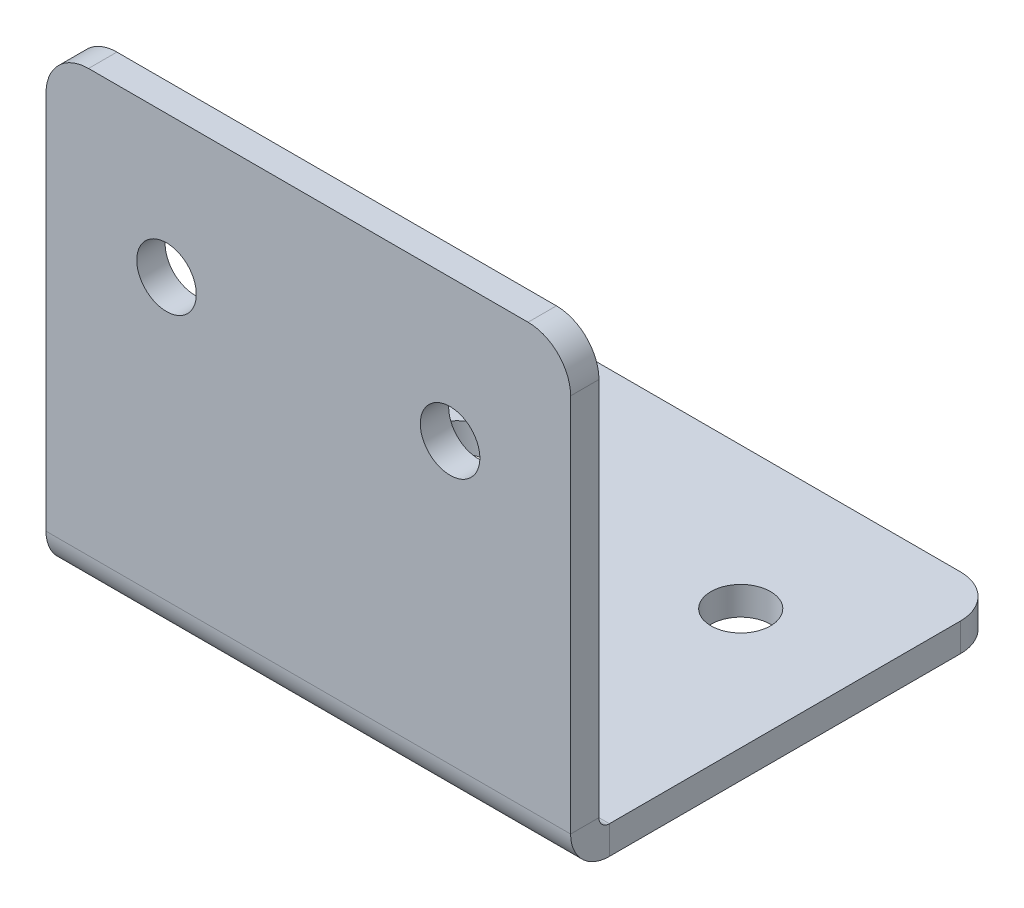
ISO-10303-21;
HEADER;
FILE_DESCRIPTION(('STEP AP214'),'2;1');
FILE_NAME('part.step','',(''),(''),'','','');
FILE_SCHEMA(('AUTOMOTIVE_DESIGN { 1 0 10303 214 1 1 1 1 }'));
ENDSEC;
DATA;
#1=APPLICATION_CONTEXT('core data for automotive mechanical design processes');
#2=APPLICATION_PROTOCOL_DEFINITION('international standard','automotive_design',2000,#1);
#3=PRODUCT_CONTEXT('',#1,'mechanical');
#4=PRODUCT('Part','Part','',(#3));
#5=PRODUCT_RELATED_PRODUCT_CATEGORY('part','',(#4));
#6=PRODUCT_DEFINITION_FORMATION('','',#4);
#7=PRODUCT_DEFINITION_CONTEXT('part definition',#1,'design');
#8=PRODUCT_DEFINITION('design','',#6,#7);
#9=PRODUCT_DEFINITION_SHAPE('','',#8);
#10=(LENGTH_UNIT() NAMED_UNIT(*) SI_UNIT(.MILLI.,.METRE.));
#11=(NAMED_UNIT(*) PLANE_ANGLE_UNIT() SI_UNIT($,.RADIAN.));
#12=(NAMED_UNIT(*) SI_UNIT($,.STERADIAN.) SOLID_ANGLE_UNIT());
#13=UNCERTAINTY_MEASURE_WITH_UNIT(LENGTH_MEASURE(1.E-05),#10,'distance_accuracy_value','');
#14=(GEOMETRIC_REPRESENTATION_CONTEXT(3) GLOBAL_UNCERTAINTY_ASSIGNED_CONTEXT((#13)) GLOBAL_UNIT_ASSIGNED_CONTEXT((#10,
#11,#12)) REPRESENTATION_CONTEXT('',''));
#15=CARTESIAN_POINT('',(0.,0.,0.));
#16=DIRECTION('',(0.,0.,1.));
#17=DIRECTION('',(1.,0.,0.));
#18=AXIS2_PLACEMENT_3D('',#15,#16,#17);
#19=CARTESIAN_POINT('',(18.5,-2.,-13.75));
#20=DIRECTION('',(1.,0.,0.));
#21=DIRECTION('',(0.,0.,-1.));
#22=AXIS2_PLACEMENT_3D('',#19,#20,#21);
#23=PLANE('',#22);
#24=DIRECTION('',(0.,0.,-1.));
#25=VECTOR('',#24,1.);
#26=CARTESIAN_POINT('',(18.5,0.,-13.75));
#27=LINE('',#26,#25);
#28=CARTESIAN_POINT('',(18.5,0.,11.0134));
#29=VERTEX_POINT('',#28);
#30=CARTESIAN_POINT('',(18.5,0.,-13.75));
#31=VERTEX_POINT('',#30);
#32=EDGE_CURVE('E260',#29,#31,#27,.T.);
#33=ORIENTED_EDGE('',*,*,#32,.F.);
#34=DIRECTION('',(0.,-1.,0.));
#35=VECTOR('',#34,1.);
#36=CARTESIAN_POINT('',(18.5,0.,11.0134));
#37=LINE('',#36,#35);
#38=CARTESIAN_POINT('',(18.5,-2.,11.0134));
#39=VERTEX_POINT('',#38);
#40=EDGE_CURVE('E235',#29,#39,#37,.T.);
#41=ORIENTED_EDGE('',*,*,#40,.T.);
#42=DIRECTION('',(0.,0.,-1.));
#43=VECTOR('',#42,1.);
#44=CARTESIAN_POINT('',(18.5,-2.,-13.75));
#45=LINE('',#44,#43);
#46=CARTESIAN_POINT('',(18.5,-2.,-13.75));
#47=VERTEX_POINT('',#46);
#48=EDGE_CURVE('E120',#39,#47,#45,.T.);
#49=ORIENTED_EDGE('',*,*,#48,.T.);
#50=DIRECTION('',(0.,1.,0.));
#51=VECTOR('',#50,1.);
#52=CARTESIAN_POINT('',(18.5,-2.,-13.75));
#53=LINE('',#52,#51);
#54=EDGE_CURVE('E74',#47,#31,#53,.T.);
#55=ORIENTED_EDGE('',*,*,#54,.T.);
#56=EDGE_LOOP('',(#33,#41,#49,#55));
#57=FACE_BOUND('',#56,.T.);
#58=ADVANCED_FACE('F71',(#57),#23,.T.);
#59=CARTESIAN_POINT('',(-15.5,-2.,-13.75));
#60=DIRECTION('',(0.,1.,0.));
#61=DIRECTION('',(0.,0.,1.));
#62=AXIS2_PLACEMENT_3D('',#59,#60,#61);
#63=PLANE('',#62);
#64=CARTESIAN_POINT('',(-10.,-2.,-6.75));
#65=DIRECTION('',(0.,1.,0.));
#66=DIRECTION('',(0.,0.,1.));
#67=AXIS2_PLACEMENT_3D('',#64,#65,#66);
#68=CIRCLE('',#67,2.1);
#69=CARTESIAN_POINT('',(-10.,-2.,-4.65));
#70=VERTEX_POINT('',#69);
#71=EDGE_CURVE('E257',#70,#70,#68,.T.);
#72=ORIENTED_EDGE('',*,*,#71,.T.);
#73=EDGE_LOOP('',(#72));
#74=FACE_BOUND('',#73,.T.);
#75=CARTESIAN_POINT('',(10.,-2.,-6.75));
#76=DIRECTION('',(0.,1.,0.));
#77=DIRECTION('',(0.,0.,-1.));
#78=AXIS2_PLACEMENT_3D('',#75,#76,#77);
#79=CIRCLE('',#78,2.1);
#80=CARTESIAN_POINT('',(10.,-2.,-8.85));
#81=VERTEX_POINT('',#80);
#82=EDGE_CURVE('E251',#81,#81,#79,.T.);
#83=ORIENTED_EDGE('',*,*,#82,.T.);
#84=EDGE_LOOP('',(#83));
#85=FACE_BOUND('',#84,.T.);
#86=DIRECTION('',(1.,0.,0.));
#87=VECTOR('',#86,1.);
#88=CARTESIAN_POINT('',(18.5,-2.,11.0134));
#89=LINE('',#88,#87);
#90=CARTESIAN_POINT('',(-18.5,-2.,11.0134));
#91=VERTEX_POINT('',#90);
#92=EDGE_CURVE('E229',#39,#91,#89,.F.);
#93=ORIENTED_EDGE('',*,*,#92,.T.);
#94=DIRECTION('',(0.,0.,1.));
#95=VECTOR('',#94,1.);
#96=CARTESIAN_POINT('',(-18.5,-2.,-13.75));
#97=LINE('',#96,#95);
#98=CARTESIAN_POINT('',(-18.5,-2.,-13.75));
#99=VERTEX_POINT('',#98);
#100=EDGE_CURVE('E273',#99,#91,#97,.T.);
#101=ORIENTED_EDGE('',*,*,#100,.F.);
#102=CARTESIAN_POINT('',(-15.5,-2.,-13.75));
#103=DIRECTION('',(0.,1.,0.));
#104=DIRECTION('',(0.,0.,1.));
#105=AXIS2_PLACEMENT_3D('',#102,#103,#104);
#106=CIRCLE('',#105,3.);
#107=CARTESIAN_POINT('',(-15.5,-2.,-16.75));
#108=VERTEX_POINT('',#107);
#109=EDGE_CURVE('E271',#108,#99,#106,.T.);
#110=ORIENTED_EDGE('',*,*,#109,.F.);
#111=DIRECTION('',(-1.,0.,0.));
#112=VECTOR('',#111,1.);
#113=CARTESIAN_POINT('',(-15.5,-2.,-16.75));
#114=LINE('',#113,#112);
#115=CARTESIAN_POINT('',(15.5,-2.,-16.75));
#116=VERTEX_POINT('',#115);
#117=EDGE_CURVE('E268',#116,#108,#114,.T.);
#118=ORIENTED_EDGE('',*,*,#117,.F.);
#119=CARTESIAN_POINT('',(15.5,-2.,-13.75));
#120=DIRECTION('',(0.,1.,0.));
#121=DIRECTION('',(0.,0.,-1.));
#122=AXIS2_PLACEMENT_3D('',#119,#120,#121);
#123=CIRCLE('',#122,3.);
#124=EDGE_CURVE('E264',#47,#116,#123,.T.);
#125=ORIENTED_EDGE('',*,*,#124,.F.);
#126=ORIENTED_EDGE('',*,*,#48,.F.);
#127=EDGE_LOOP('',(#93,#101,#110,#118,#125,#126));
#128=FACE_BOUND('',#127,.T.);
#129=ADVANCED_FACE('F309',(#74,#85,#128),#63,.F.);
#130=CARTESIAN_POINT('',(-15.5,0.,-13.75));
#131=DIRECTION('',(0.,1.,0.));
#132=DIRECTION('',(0.,0.,1.));
#133=AXIS2_PLACEMENT_3D('',#130,#131,#132);
#134=PLANE('',#133);
#135=CARTESIAN_POINT('',(10.,0.,-6.75));
#136=DIRECTION('',(0.,1.,0.));
#137=DIRECTION('',(0.,0.,-1.));
#138=AXIS2_PLACEMENT_3D('',#135,#136,#137);
#139=CIRCLE('',#138,2.1);
#140=CARTESIAN_POINT('',(10.,0.,-8.85));
#141=VERTEX_POINT('',#140);
#142=EDGE_CURVE('E249',#141,#141,#139,.T.);
#143=ORIENTED_EDGE('',*,*,#142,.F.);
#144=EDGE_LOOP('',(#143));
#145=FACE_BOUND('',#144,.T.);
#146=CARTESIAN_POINT('',(-10.,0.,-6.75));
#147=DIRECTION('',(0.,1.,0.));
#148=DIRECTION('',(0.,0.,1.));
#149=AXIS2_PLACEMENT_3D('',#146,#147,#148);
#150=CIRCLE('',#149,2.1);
#151=CARTESIAN_POINT('',(-10.,0.,-4.65));
#152=VERTEX_POINT('',#151);
#153=EDGE_CURVE('E254',#152,#152,#150,.T.);
#154=ORIENTED_EDGE('',*,*,#153,.F.);
#155=EDGE_LOOP('',(#154));
#156=FACE_BOUND('',#155,.T.);
#157=DIRECTION('',(0.,0.,1.));
#158=VECTOR('',#157,1.);
#159=CARTESIAN_POINT('',(-18.5,0.,-13.75));
#160=LINE('',#159,#158);
#161=CARTESIAN_POINT('',(-18.5,0.,-13.75));
#162=VERTEX_POINT('',#161);
#163=CARTESIAN_POINT('',(-18.5,0.,11.0134));
#164=VERTEX_POINT('',#163);
#165=EDGE_CURVE('E265',#162,#164,#160,.T.);
#166=ORIENTED_EDGE('',*,*,#165,.T.);
#167=DIRECTION('',(1.,0.,0.));
#168=VECTOR('',#167,1.);
#169=CARTESIAN_POINT('',(18.5,0.,11.0134));
#170=LINE('',#169,#168);
#171=EDGE_CURVE('E87',#29,#164,#170,.F.);
#172=ORIENTED_EDGE('',*,*,#171,.F.);
#173=ORIENTED_EDGE('',*,*,#32,.T.);
#174=CARTESIAN_POINT('',(15.5,0.,-13.75));
#175=DIRECTION('',(0.,1.,0.));
#176=DIRECTION('',(0.,0.,-1.));
#177=AXIS2_PLACEMENT_3D('',#174,#175,#176);
#178=CIRCLE('',#177,3.);
#179=CARTESIAN_POINT('',(15.5,0.,-16.75));
#180=VERTEX_POINT('',#179);
#181=EDGE_CURVE('E276',#31,#180,#178,.T.);
#182=ORIENTED_EDGE('',*,*,#181,.T.);
#183=DIRECTION('',(-1.,0.,0.));
#184=VECTOR('',#183,1.);
#185=CARTESIAN_POINT('',(-15.5,0.,-16.75));
#186=LINE('',#185,#184);
#187=CARTESIAN_POINT('',(-15.5,0.,-16.75));
#188=VERTEX_POINT('',#187);
#189=EDGE_CURVE('E279',#180,#188,#186,.T.);
#190=ORIENTED_EDGE('',*,*,#189,.T.);
#191=CARTESIAN_POINT('',(-15.5,0.,-13.75));
#192=DIRECTION('',(0.,1.,0.));
#193=DIRECTION('',(0.,0.,1.));
#194=AXIS2_PLACEMENT_3D('',#191,#192,#193);
#195=CIRCLE('',#194,3.);
#196=EDGE_CURVE('E282',#188,#162,#195,.T.);
#197=ORIENTED_EDGE('',*,*,#196,.T.);
#198=EDGE_LOOP('',(#166,#172,#173,#182,#190,#197));
#199=FACE_BOUND('',#198,.T.);
#200=ADVANCED_FACE('F293',(#145,#156,#199),#134,.T.);
#201=CARTESIAN_POINT('',(-18.5,-2.,-13.75));
#202=DIRECTION('',(-1.,0.,0.));
#203=DIRECTION('',(0.,0.,1.));
#204=AXIS2_PLACEMENT_3D('',#201,#202,#203);
#205=PLANE('',#204);
#206=DIRECTION('',(0.,-1.,0.));
#207=VECTOR('',#206,1.);
#208=CARTESIAN_POINT('',(-18.5,0.,11.0134));
#209=LINE('',#208,#207);
#210=EDGE_CURVE('E246',#164,#91,#209,.T.);
#211=ORIENTED_EDGE('',*,*,#210,.F.);
#212=ORIENTED_EDGE('',*,*,#165,.F.);
#213=DIRECTION('',(0.,1.,0.));
#214=VECTOR('',#213,1.);
#215=CARTESIAN_POINT('',(-18.5,-2.,-13.75));
#216=LINE('',#215,#214);
#217=EDGE_CURVE('E13',#99,#162,#216,.T.);
#218=ORIENTED_EDGE('',*,*,#217,.F.);
#219=ORIENTED_EDGE('',*,*,#100,.T.);
#220=EDGE_LOOP('',(#211,#212,#218,#219));
#221=FACE_BOUND('',#220,.T.);
#222=ADVANCED_FACE('F300',(#221),#205,.T.);
#223=CARTESIAN_POINT('',(-15.5,-2.,-13.75));
#224=DIRECTION('',(0.,1.,0.));
#225=DIRECTION('',(0.,0.,1.));
#226=AXIS2_PLACEMENT_3D('',#223,#224,#225);
#227=CYLINDRICAL_SURFACE('',#226,3.);
#228=ORIENTED_EDGE('',*,*,#196,.F.);
#229=DIRECTION('',(0.,1.,0.));
#230=VECTOR('',#229,1.);
#231=CARTESIAN_POINT('',(-15.5,-2.,-16.75));
#232=LINE('',#231,#230);
#233=EDGE_CURVE('E79',#108,#188,#232,.T.);
#234=ORIENTED_EDGE('',*,*,#233,.F.);
#235=ORIENTED_EDGE('',*,*,#109,.T.);
#236=ORIENTED_EDGE('',*,*,#217,.T.);
#237=EDGE_LOOP('',(#228,#234,#235,#236));
#238=FACE_BOUND('',#237,.T.);
#239=ADVANCED_FACE('F298',(#238),#227,.T.);
#240=CARTESIAN_POINT('',(-15.5,-2.,-16.75));
#241=DIRECTION('',(0.,0.,-1.));
#242=DIRECTION('',(-1.,0.,0.));
#243=AXIS2_PLACEMENT_3D('',#240,#241,#242);
#244=PLANE('',#243);
#245=ORIENTED_EDGE('',*,*,#189,.F.);
#246=DIRECTION('',(0.,1.,0.));
#247=VECTOR('',#246,1.);
#248=CARTESIAN_POINT('',(15.5,-2.,-16.75));
#249=LINE('',#248,#247);
#250=EDGE_CURVE('E286',#116,#180,#249,.T.);
#251=ORIENTED_EDGE('',*,*,#250,.F.);
#252=ORIENTED_EDGE('',*,*,#117,.T.);
#253=ORIENTED_EDGE('',*,*,#233,.T.);
#254=EDGE_LOOP('',(#245,#251,#252,#253));
#255=FACE_BOUND('',#254,.T.);
#256=ADVANCED_FACE('F295',(#255),#244,.T.);
#257=CARTESIAN_POINT('',(15.5,-2.,-13.75));
#258=DIRECTION('',(0.,1.,0.));
#259=DIRECTION('',(0.,0.,1.));
#260=AXIS2_PLACEMENT_3D('',#257,#258,#259);
#261=CYLINDRICAL_SURFACE('',#260,3.);
#262=ORIENTED_EDGE('',*,*,#181,.F.);
#263=ORIENTED_EDGE('',*,*,#54,.F.);
#264=ORIENTED_EDGE('',*,*,#124,.T.);
#265=ORIENTED_EDGE('',*,*,#250,.T.);
#266=EDGE_LOOP('',(#262,#263,#264,#265));
#267=FACE_BOUND('',#266,.T.);
#268=ADVANCED_FACE('F292',(#267),#261,.T.);
#269=CARTESIAN_POINT('',(-10.,-2.,-6.75));
#270=DIRECTION('',(0.,1.,0.));
#271=DIRECTION('',(0.,0.,1.));
#272=AXIS2_PLACEMENT_3D('',#269,#270,#271);
#273=CYLINDRICAL_SURFACE('',#272,2.1);
#274=ORIENTED_EDGE('',*,*,#71,.F.);
#275=EDGE_LOOP('',(#274));
#276=FACE_BOUND('',#275,.T.);
#277=ORIENTED_EDGE('',*,*,#153,.T.);
#278=EDGE_LOOP('',(#277));
#279=FACE_BOUND('',#278,.T.);
#280=ADVANCED_FACE('F322',(#276,#279),#273,.F.);
#281=CARTESIAN_POINT('',(10.,-2.,-6.75));
#282=DIRECTION('',(0.,1.,0.));
#283=DIRECTION('',(0.,0.,1.));
#284=AXIS2_PLACEMENT_3D('',#281,#282,#283);
#285=CYLINDRICAL_SURFACE('',#284,2.1);
#286=ORIENTED_EDGE('',*,*,#82,.F.);
#287=EDGE_LOOP('',(#286));
#288=FACE_BOUND('',#287,.T.);
#289=ORIENTED_EDGE('',*,*,#142,.T.);
#290=EDGE_LOOP('',(#289));
#291=FACE_BOUND('',#290,.T.);
#292=ADVANCED_FACE('F325',(#288,#291),#285,.F.);
#293=CARTESIAN_POINT('',(-18.5,0.736599999999996,11.0134));
#294=DIRECTION('',(-1.,0.,0.));
#295=DIRECTION('',(0.,0.,1.));
#296=AXIS2_PLACEMENT_3D('',#293,#294,#295);
#297=PLANE('',#296);
#298=DIRECTION('',(0.,0.,-1.));
#299=VECTOR('',#298,1.);
#300=CARTESIAN_POINT('',(-18.5,0.736599999999997,13.75));
#301=LINE('',#300,#299);
#302=CARTESIAN_POINT('',(-18.5,0.736599999999996,11.75));
#303=VERTEX_POINT('',#302);
#304=CARTESIAN_POINT('',(-18.5,0.736599999999996,13.75));
#305=VERTEX_POINT('',#304);
#306=EDGE_CURVE('E193',#303,#305,#301,.F.);
#307=ORIENTED_EDGE('',*,*,#306,.F.);
#308=CARTESIAN_POINT('',(-18.5,0.736599999999996,11.0134));
#309=DIRECTION('',(1.,0.,0.));
#310=DIRECTION('',(0.,0.,-1.));
#311=AXIS2_PLACEMENT_3D('',#308,#309,#310);
#312=CIRCLE('',#311,0.7366);
#313=EDGE_CURVE('E238',#164,#303,#312,.F.);
#314=ORIENTED_EDGE('',*,*,#313,.F.);
#315=ORIENTED_EDGE('',*,*,#210,.T.);
#316=CARTESIAN_POINT('',(-18.5,0.736599999999996,11.0134));
#317=DIRECTION('',(1.,0.,0.));
#318=DIRECTION('',(0.,0.,-1.));
#319=AXIS2_PLACEMENT_3D('',#316,#317,#318);
#320=CIRCLE('',#319,2.7366);
#321=EDGE_CURVE('E231',#91,#305,#320,.F.);
#322=ORIENTED_EDGE('',*,*,#321,.T.);
#323=EDGE_LOOP('',(#307,#314,#315,#322));
#324=FACE_BOUND('',#323,.T.);
#325=ADVANCED_FACE('F329',(#324),#297,.T.);
#326=CARTESIAN_POINT('',(18.5,0.736599999999996,11.0134));
#327=DIRECTION('',(-1.,0.,0.));
#328=DIRECTION('',(0.,0.,1.));
#329=AXIS2_PLACEMENT_3D('',#326,#327,#328);
#330=PLANE('',#329);
#331=CARTESIAN_POINT('',(18.5,0.736599999999996,11.0134));
#332=DIRECTION('',(1.,0.,0.));
#333=DIRECTION('',(0.,0.,-1.));
#334=AXIS2_PLACEMENT_3D('',#331,#332,#333);
#335=CIRCLE('',#334,0.7366);
#336=CARTESIAN_POINT('',(18.5,0.736599999999996,11.75));
#337=VERTEX_POINT('',#336);
#338=EDGE_CURVE('E242',#337,#29,#335,.T.);
#339=ORIENTED_EDGE('',*,*,#338,.F.);
#340=DIRECTION('',(0.,0.,-1.));
#341=VECTOR('',#340,1.);
#342=CARTESIAN_POINT('',(18.5,0.736599999999995,11.75));
#343=LINE('',#342,#341);
#344=CARTESIAN_POINT('',(18.5,0.736599999999995,13.75));
#345=VERTEX_POINT('',#344);
#346=EDGE_CURVE('E223',#337,#345,#343,.F.);
#347=ORIENTED_EDGE('',*,*,#346,.T.);
#348=CARTESIAN_POINT('',(18.5,0.736599999999996,11.0134));
#349=DIRECTION('',(1.,0.,0.));
#350=DIRECTION('',(0.,0.,-1.));
#351=AXIS2_PLACEMENT_3D('',#348,#349,#350);
#352=CIRCLE('',#351,2.7366);
#353=EDGE_CURVE('E232',#345,#39,#352,.T.);
#354=ORIENTED_EDGE('',*,*,#353,.T.);
#355=ORIENTED_EDGE('',*,*,#40,.F.);
#356=EDGE_LOOP('',(#339,#347,#354,#355));
#357=FACE_BOUND('',#356,.T.);
#358=ADVANCED_FACE('F331',(#357),#330,.F.);
#359=CARTESIAN_POINT('',(18.5,0.736599999999996,11.0134));
#360=DIRECTION('',(1.,0.,0.));
#361=DIRECTION('',(0.,0.,1.));
#362=AXIS2_PLACEMENT_3D('',#359,#360,#361);
#363=CYLINDRICAL_SURFACE('',#362,2.7366);
#364=ORIENTED_EDGE('',*,*,#92,.F.);
#365=ORIENTED_EDGE('',*,*,#353,.F.);
#366=DIRECTION('',(1.,0.,0.));
#367=VECTOR('',#366,1.);
#368=CARTESIAN_POINT('',(-18.5,0.736599999999997,13.75));
#369=LINE('',#368,#367);
#370=EDGE_CURVE('E221',#345,#305,#369,.F.);
#371=ORIENTED_EDGE('',*,*,#370,.T.);
#372=ORIENTED_EDGE('',*,*,#321,.F.);
#373=EDGE_LOOP('',(#364,#365,#371,#372));
#374=FACE_BOUND('',#373,.T.);
#375=ADVANCED_FACE('F334',(#374),#363,.T.);
#376=CARTESIAN_POINT('',(18.5,0.736599999999996,11.0134));
#377=DIRECTION('',(1.,0.,0.));
#378=DIRECTION('',(0.,0.,1.));
#379=AXIS2_PLACEMENT_3D('',#376,#377,#378);
#380=CYLINDRICAL_SURFACE('',#379,0.7366);
#381=ORIENTED_EDGE('',*,*,#171,.T.);
#382=ORIENTED_EDGE('',*,*,#313,.T.);
#383=DIRECTION('',(1.,0.,0.));
#384=VECTOR('',#383,1.);
#385=CARTESIAN_POINT('',(-18.5,0.736599999999997,11.75));
#386=LINE('',#385,#384);
#387=EDGE_CURVE('E226',#303,#337,#386,.T.);
#388=ORIENTED_EDGE('',*,*,#387,.T.);
#389=ORIENTED_EDGE('',*,*,#338,.T.);
#390=EDGE_LOOP('',(#381,#382,#388,#389));
#391=FACE_BOUND('',#390,.T.);
#392=ADVANCED_FACE('F339',(#391),#380,.F.);
#393=CARTESIAN_POINT('',(-15.5,27.5,13.75));
#394=DIRECTION('',(0.,0.,-1.));
#395=DIRECTION('',(-1.,0.,0.));
#396=AXIS2_PLACEMENT_3D('',#393,#394,#395);
#397=PLANE('',#396);
#398=CARTESIAN_POINT('',(10.,20.5,13.75));
#399=DIRECTION('',(0.,0.,-1.));
#400=DIRECTION('',(-1.,0.,0.));
#401=AXIS2_PLACEMENT_3D('',#398,#399,#400);
#402=CIRCLE('',#401,2.1);
#403=CARTESIAN_POINT('',(7.9,20.5,13.75));
#404=VERTEX_POINT('',#403);
#405=EDGE_CURVE('E215',#404,#404,#402,.F.);
#406=ORIENTED_EDGE('',*,*,#405,.F.);
#407=EDGE_LOOP('',(#406));
#408=FACE_BOUND('',#407,.T.);
#409=CARTESIAN_POINT('',(-10.,20.5,13.75));
#410=DIRECTION('',(0.,0.,-1.));
#411=DIRECTION('',(-1.,0.,0.));
#412=AXIS2_PLACEMENT_3D('',#409,#410,#411);
#413=CIRCLE('',#412,2.1);
#414=CARTESIAN_POINT('',(-12.1,20.5,13.75));
#415=VERTEX_POINT('',#414);
#416=EDGE_CURVE('E209',#415,#415,#413,.F.);
#417=ORIENTED_EDGE('',*,*,#416,.F.);
#418=EDGE_LOOP('',(#417));
#419=FACE_BOUND('',#418,.T.);
#420=ORIENTED_EDGE('',*,*,#370,.F.);
#421=DIRECTION('',(0.,1.,0.));
#422=VECTOR('',#421,1.);
#423=CARTESIAN_POINT('',(18.5,27.5,13.75));
#424=LINE('',#423,#422);
#425=CARTESIAN_POINT('',(18.5,27.5,13.75));
#426=VERTEX_POINT('',#425);
#427=EDGE_CURVE('E194',#345,#426,#424,.T.);
#428=ORIENTED_EDGE('',*,*,#427,.T.);
#429=CARTESIAN_POINT('',(15.5,27.5,13.75));
#430=DIRECTION('',(0.,0.,-1.));
#431=DIRECTION('',(-1.,0.,0.));
#432=AXIS2_PLACEMENT_3D('',#429,#430,#431);
#433=CIRCLE('',#432,3.);
#434=CARTESIAN_POINT('',(15.5,30.5,13.75));
#435=VERTEX_POINT('',#434);
#436=EDGE_CURVE('E196',#426,#435,#433,.F.);
#437=ORIENTED_EDGE('',*,*,#436,.T.);
#438=DIRECTION('',(-1.,0.,0.));
#439=VECTOR('',#438,1.);
#440=CARTESIAN_POINT('',(-15.5,30.5,13.75));
#441=LINE('',#440,#439);
#442=CARTESIAN_POINT('',(-15.5,30.5,13.75));
#443=VERTEX_POINT('',#442);
#444=EDGE_CURVE('E176',#435,#443,#441,.T.);
#445=ORIENTED_EDGE('',*,*,#444,.T.);
#446=CARTESIAN_POINT('',(-15.5,27.5,13.75));
#447=DIRECTION('',(0.,0.,-1.));
#448=DIRECTION('',(-1.,0.,0.));
#449=AXIS2_PLACEMENT_3D('',#446,#447,#448);
#450=CIRCLE('',#449,3.);
#451=CARTESIAN_POINT('',(-18.5,27.5,13.75));
#452=VERTEX_POINT('',#451);
#453=EDGE_CURVE('E169',#443,#452,#450,.F.);
#454=ORIENTED_EDGE('',*,*,#453,.T.);
#455=DIRECTION('',(0.,-1.,0.));
#456=VECTOR('',#455,1.);
#457=CARTESIAN_POINT('',(-18.5,27.5,13.75));
#458=LINE('',#457,#456);
#459=EDGE_CURVE('E174',#452,#305,#458,.T.);
#460=ORIENTED_EDGE('',*,*,#459,.T.);
#461=EDGE_LOOP('',(#420,#428,#437,#445,#454,#460));
#462=FACE_BOUND('',#461,.T.);
#463=ADVANCED_FACE('F172',(#408,#419,#462),#397,.F.);
#464=CARTESIAN_POINT('',(-15.5,27.5,11.75));
#465=DIRECTION('',(0.,0.,-1.));
#466=DIRECTION('',(-1.,0.,0.));
#467=AXIS2_PLACEMENT_3D('',#464,#465,#466);
#468=PLANE('',#467);
#469=CARTESIAN_POINT('',(-10.,20.5,11.75));
#470=DIRECTION('',(0.,0.,-1.));
#471=DIRECTION('',(-1.,0.,0.));
#472=AXIS2_PLACEMENT_3D('',#469,#470,#471);
#473=CIRCLE('',#472,2.1);
#474=CARTESIAN_POINT('',(-12.1,20.5,11.75));
#475=VERTEX_POINT('',#474);
#476=EDGE_CURVE('E212',#475,#475,#473,.F.);
#477=ORIENTED_EDGE('',*,*,#476,.T.);
#478=EDGE_LOOP('',(#477));
#479=FACE_BOUND('',#478,.T.);
#480=CARTESIAN_POINT('',(10.,20.5,11.75));
#481=DIRECTION('',(0.,0.,-1.));
#482=DIRECTION('',(-1.,0.,0.));
#483=AXIS2_PLACEMENT_3D('',#480,#481,#482);
#484=CIRCLE('',#483,2.1);
#485=CARTESIAN_POINT('',(7.9,20.5,11.75));
#486=VERTEX_POINT('',#485);
#487=EDGE_CURVE('E218',#486,#486,#484,.F.);
#488=ORIENTED_EDGE('',*,*,#487,.T.);
#489=EDGE_LOOP('',(#488));
#490=FACE_BOUND('',#489,.T.);
#491=DIRECTION('',(0.,-1.,0.));
#492=VECTOR('',#491,1.);
#493=CARTESIAN_POINT('',(18.5,27.5,11.75));
#494=LINE('',#493,#492);
#495=CARTESIAN_POINT('',(18.5,27.5,11.75));
#496=VERTEX_POINT('',#495);
#497=EDGE_CURVE('E205',#337,#496,#494,.F.);
#498=ORIENTED_EDGE('',*,*,#497,.F.);
#499=ORIENTED_EDGE('',*,*,#387,.F.);
#500=DIRECTION('',(0.,1.,0.));
#501=VECTOR('',#500,1.);
#502=CARTESIAN_POINT('',(-18.5,0.,11.75));
#503=LINE('',#502,#501);
#504=CARTESIAN_POINT('',(-18.5,27.5,11.75));
#505=VERTEX_POINT('',#504);
#506=EDGE_CURVE('E207',#505,#303,#503,.F.);
#507=ORIENTED_EDGE('',*,*,#506,.F.);
#508=CARTESIAN_POINT('',(-15.5,27.5,11.75));
#509=DIRECTION('',(0.,0.,-1.));
#510=DIRECTION('',(-1.,0.,0.));
#511=AXIS2_PLACEMENT_3D('',#508,#509,#510);
#512=CIRCLE('',#511,3.);
#513=CARTESIAN_POINT('',(-15.5,30.5,11.75));
#514=VERTEX_POINT('',#513);
#515=EDGE_CURVE('E185',#514,#505,#512,.F.);
#516=ORIENTED_EDGE('',*,*,#515,.F.);
#517=DIRECTION('',(1.,0.,0.));
#518=VECTOR('',#517,1.);
#519=CARTESIAN_POINT('',(-15.5,30.5,11.75));
#520=LINE('',#519,#518);
#521=CARTESIAN_POINT('',(15.5,30.5,11.75));
#522=VERTEX_POINT('',#521);
#523=EDGE_CURVE('E198',#522,#514,#520,.F.);
#524=ORIENTED_EDGE('',*,*,#523,.F.);
#525=CARTESIAN_POINT('',(15.5,27.5,11.75));
#526=DIRECTION('',(0.,0.,-1.));
#527=DIRECTION('',(-1.,0.,0.));
#528=AXIS2_PLACEMENT_3D('',#525,#526,#527);
#529=CIRCLE('',#528,3.);
#530=EDGE_CURVE('E203',#496,#522,#529,.F.);
#531=ORIENTED_EDGE('',*,*,#530,.F.);
#532=EDGE_LOOP('',(#498,#499,#507,#516,#524,#531));
#533=FACE_BOUND('',#532,.T.);
#534=ADVANCED_FACE('F349',(#479,#490,#533),#468,.T.);
#535=CARTESIAN_POINT('',(-18.5,0.,13.75));
#536=DIRECTION('',(1.,0.,0.));
#537=DIRECTION('',(0.,0.,-1.));
#538=AXIS2_PLACEMENT_3D('',#535,#536,#537);
#539=PLANE('',#538);
#540=ORIENTED_EDGE('',*,*,#306,.T.);
#541=ORIENTED_EDGE('',*,*,#459,.F.);
#542=DIRECTION('',(0.,0.,-1.));
#543=VECTOR('',#542,1.);
#544=CARTESIAN_POINT('',(-18.5,27.5,13.75));
#545=LINE('',#544,#543);
#546=EDGE_CURVE('E180',#452,#505,#545,.T.);
#547=ORIENTED_EDGE('',*,*,#546,.T.);
#548=ORIENTED_EDGE('',*,*,#506,.T.);
#549=EDGE_LOOP('',(#540,#541,#547,#548));
#550=FACE_BOUND('',#549,.T.);
#551=ADVANCED_FACE('F192',(#550),#539,.F.);
#552=CARTESIAN_POINT('',(18.5,27.5,13.75));
#553=DIRECTION('',(-1.,0.,0.));
#554=DIRECTION('',(0.,0.,1.));
#555=AXIS2_PLACEMENT_3D('',#552,#553,#554);
#556=PLANE('',#555);
#557=ORIENTED_EDGE('',*,*,#346,.F.);
#558=ORIENTED_EDGE('',*,*,#497,.T.);
#559=DIRECTION('',(0.,0.,-1.));
#560=VECTOR('',#559,1.);
#561=CARTESIAN_POINT('',(18.5,27.5,13.75));
#562=LINE('',#561,#560);
#563=EDGE_CURVE('E245',#426,#496,#562,.T.);
#564=ORIENTED_EDGE('',*,*,#563,.F.);
#565=ORIENTED_EDGE('',*,*,#427,.F.);
#566=EDGE_LOOP('',(#557,#558,#564,#565));
#567=FACE_BOUND('',#566,.T.);
#568=ADVANCED_FACE('F348',(#567),#556,.F.);
#569=CARTESIAN_POINT('',(15.5,27.5,13.75));
#570=DIRECTION('',(0.,0.,-1.));
#571=DIRECTION('',(-1.,0.,0.));
#572=AXIS2_PLACEMENT_3D('',#569,#570,#571);
#573=CYLINDRICAL_SURFACE('',#572,3.);
#574=ORIENTED_EDGE('',*,*,#530,.T.);
#575=DIRECTION('',(0.,0.,-1.));
#576=VECTOR('',#575,1.);
#577=CARTESIAN_POINT('',(15.5,30.5,13.75));
#578=LINE('',#577,#576);
#579=EDGE_CURVE('E394',#435,#522,#578,.T.);
#580=ORIENTED_EDGE('',*,*,#579,.F.);
#581=ORIENTED_EDGE('',*,*,#436,.F.);
#582=ORIENTED_EDGE('',*,*,#563,.T.);
#583=EDGE_LOOP('',(#574,#580,#581,#582));
#584=FACE_BOUND('',#583,.T.);
#585=ADVANCED_FACE('F352',(#584),#573,.T.);
#586=CARTESIAN_POINT('',(-15.5,30.5,13.75));
#587=DIRECTION('',(0.,-1.,0.));
#588=DIRECTION('',(0.,0.,-1.));
#589=AXIS2_PLACEMENT_3D('',#586,#587,#588);
#590=PLANE('',#589);
#591=ORIENTED_EDGE('',*,*,#523,.T.);
#592=DIRECTION('',(0.,0.,-1.));
#593=VECTOR('',#592,1.);
#594=CARTESIAN_POINT('',(-15.5,30.5,13.75));
#595=LINE('',#594,#593);
#596=EDGE_CURVE('E189',#443,#514,#595,.T.);
#597=ORIENTED_EDGE('',*,*,#596,.F.);
#598=ORIENTED_EDGE('',*,*,#444,.F.);
#599=ORIENTED_EDGE('',*,*,#579,.T.);
#600=EDGE_LOOP('',(#591,#597,#598,#599));
#601=FACE_BOUND('',#600,.T.);
#602=ADVANCED_FACE('F356',(#601),#590,.F.);
#603=CARTESIAN_POINT('',(-15.5,27.5,13.75));
#604=DIRECTION('',(0.,0.,-1.));
#605=DIRECTION('',(-1.,0.,0.));
#606=AXIS2_PLACEMENT_3D('',#603,#604,#605);
#607=CYLINDRICAL_SURFACE('',#606,3.);
#608=ORIENTED_EDGE('',*,*,#515,.T.);
#609=ORIENTED_EDGE('',*,*,#546,.F.);
#610=ORIENTED_EDGE('',*,*,#453,.F.);
#611=ORIENTED_EDGE('',*,*,#596,.T.);
#612=EDGE_LOOP('',(#608,#609,#610,#611));
#613=FACE_BOUND('',#612,.T.);
#614=ADVANCED_FACE('F183',(#613),#607,.T.);
#615=CARTESIAN_POINT('',(-10.,20.5,13.75));
#616=DIRECTION('',(0.,0.,-1.));
#617=DIRECTION('',(-1.,0.,0.));
#618=AXIS2_PLACEMENT_3D('',#615,#616,#617);
#619=CYLINDRICAL_SURFACE('',#618,2.1);
#620=ORIENTED_EDGE('',*,*,#416,.T.);
#621=EDGE_LOOP('',(#620));
#622=FACE_BOUND('',#621,.T.);
#623=ORIENTED_EDGE('',*,*,#476,.F.);
#624=EDGE_LOOP('',(#623));
#625=FACE_BOUND('',#624,.T.);
#626=ADVANCED_FACE('F363',(#622,#625),#619,.F.);
#627=CARTESIAN_POINT('',(10.,20.5,13.75));
#628=DIRECTION('',(0.,0.,-1.));
#629=DIRECTION('',(-1.,0.,0.));
#630=AXIS2_PLACEMENT_3D('',#627,#628,#629);
#631=CYLINDRICAL_SURFACE('',#630,2.1);
#632=ORIENTED_EDGE('',*,*,#405,.T.);
#633=EDGE_LOOP('',(#632));
#634=FACE_BOUND('',#633,.T.);
#635=ORIENTED_EDGE('',*,*,#487,.F.);
#636=EDGE_LOOP('',(#635));
#637=FACE_BOUND('',#636,.T.);
#638=ADVANCED_FACE('F372',(#634,#637),#631,.F.);
#639=CLOSED_SHELL('',(#58,#129,#200,#222,#239,#256,#268,#280,#292,#325,#358,#375,#392,#463,#534,
#551,#568,#585,#602,#614,#626,#638));
#640=MANIFOLD_SOLID_BREP('B2',#639);
#641=ADVANCED_BREP_SHAPE_REPRESENTATION('',(#18,#640),#14);
#642=SHAPE_DEFINITION_REPRESENTATION(#9,#641);
ENDSEC;
END-ISO-10303-21;
